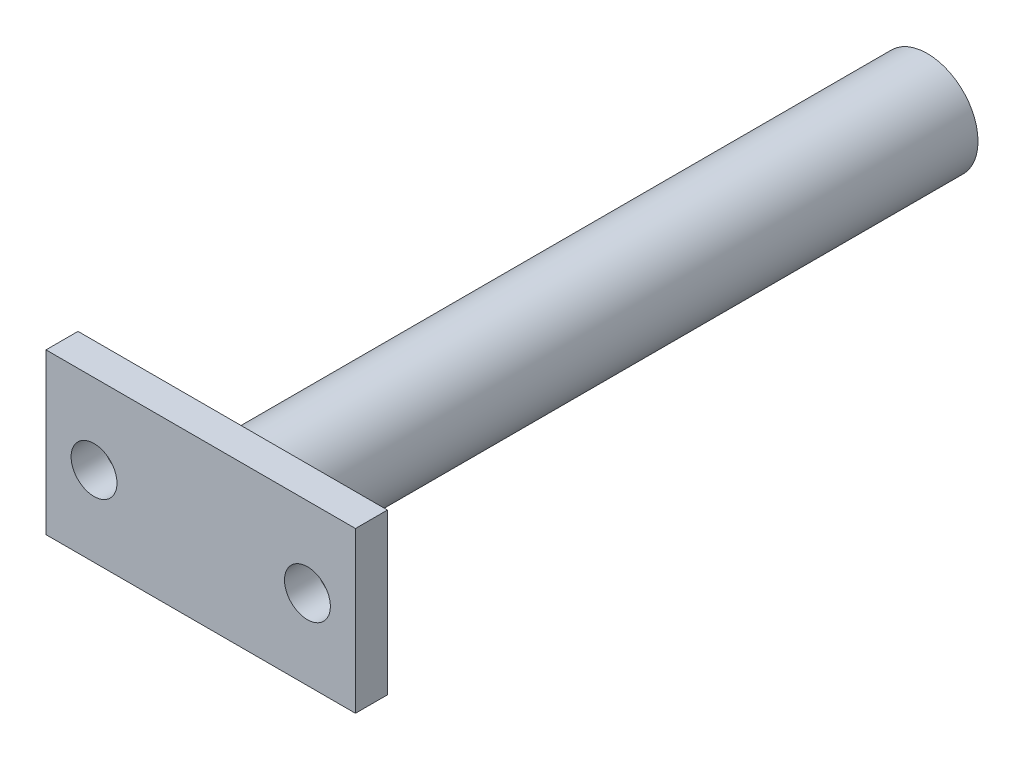
ISO-10303-21;
HEADER;
FILE_DESCRIPTION(('STEP AP214'),'2;1');
FILE_NAME('part.step','',(''),(''),'','','');
FILE_SCHEMA(('AUTOMOTIVE_DESIGN { 1 0 10303 214 1 1 1 1 }'));
ENDSEC;
DATA;
#1=APPLICATION_CONTEXT('core data for automotive mechanical design processes');
#2=APPLICATION_PROTOCOL_DEFINITION('international standard','automotive_design',2000,#1);
#3=PRODUCT_CONTEXT('',#1,'mechanical');
#4=PRODUCT('Part','Part','',(#3));
#5=PRODUCT_RELATED_PRODUCT_CATEGORY('part','',(#4));
#6=PRODUCT_DEFINITION_FORMATION('','',#4);
#7=PRODUCT_DEFINITION_CONTEXT('part definition',#1,'design');
#8=PRODUCT_DEFINITION('design','',#6,#7);
#9=PRODUCT_DEFINITION_SHAPE('','',#8);
#10=(LENGTH_UNIT() NAMED_UNIT(*) SI_UNIT(.MILLI.,.METRE.));
#11=(NAMED_UNIT(*) PLANE_ANGLE_UNIT() SI_UNIT($,.RADIAN.));
#12=(NAMED_UNIT(*) SI_UNIT($,.STERADIAN.) SOLID_ANGLE_UNIT());
#13=UNCERTAINTY_MEASURE_WITH_UNIT(LENGTH_MEASURE(1.E-05),#10,'distance_accuracy_value','');
#14=(GEOMETRIC_REPRESENTATION_CONTEXT(3) GLOBAL_UNCERTAINTY_ASSIGNED_CONTEXT((#13)) GLOBAL_UNIT_ASSIGNED_CONTEXT((#10,
#11,#12)) REPRESENTATION_CONTEXT('',''));
#15=CARTESIAN_POINT('',(0.,0.,0.));
#16=DIRECTION('',(0.,0.,1.));
#17=DIRECTION('',(1.,0.,0.));
#18=AXIS2_PLACEMENT_3D('',#15,#16,#17);
#19=CARTESIAN_POINT('',(-27.6328666396553,0.,3.));
#20=DIRECTION('',(-1.,0.,0.));
#21=DIRECTION('',(0.,0.,1.));
#22=AXIS2_PLACEMENT_3D('',#19,#20,#21);
#23=PLANE('',#22);
#24=DIRECTION('',(0.,1.,0.));
#25=VECTOR('',#24,1.);
#26=CARTESIAN_POINT('',(-27.6328666396553,0.,0.));
#27=LINE('',#26,#25);
#28=CARTESIAN_POINT('',(-27.6328666396553,0.593964388251606,0.));
#29=VERTEX_POINT('',#28);
#30=CARTESIAN_POINT('',(-27.6328666396553,15.5939643882516,0.));
#31=VERTEX_POINT('',#30);
#32=EDGE_CURVE('E105',#29,#31,#27,.T.);
#33=ORIENTED_EDGE('',*,*,#32,.F.);
#34=DIRECTION('',(0.,0.,-1.));
#35=VECTOR('',#34,1.);
#36=CARTESIAN_POINT('',(-27.6328666396553,0.593964388251606,3.));
#37=LINE('',#36,#35);
#38=CARTESIAN_POINT('',(-27.6328666396553,0.593964388251606,3.));
#39=VERTEX_POINT('',#38);
#40=EDGE_CURVE('E11',#39,#29,#37,.T.);
#41=ORIENTED_EDGE('',*,*,#40,.F.);
#42=DIRECTION('',(0.,1.,0.));
#43=VECTOR('',#42,1.);
#44=CARTESIAN_POINT('',(-27.6328666396553,0.,3.));
#45=LINE('',#44,#43);
#46=CARTESIAN_POINT('',(-27.6328666396553,15.5939643882516,3.));
#47=VERTEX_POINT('',#46);
#48=EDGE_CURVE('E89',#39,#47,#45,.T.);
#49=ORIENTED_EDGE('',*,*,#48,.T.);
#50=DIRECTION('',(0.,0.,-1.));
#51=VECTOR('',#50,1.);
#52=CARTESIAN_POINT('',(-27.6328666396553,15.5939643882516,3.));
#53=LINE('',#52,#51);
#54=EDGE_CURVE('E51',#47,#31,#53,.T.);
#55=ORIENTED_EDGE('',*,*,#54,.T.);
#56=EDGE_LOOP('',(#33,#41,#49,#55));
#57=FACE_BOUND('',#56,.T.);
#58=ADVANCED_FACE('F34',(#57),#23,.T.);
#59=CARTESIAN_POINT('',(0.,0.593964388251606,3.));
#60=DIRECTION('',(0.,1.,0.));
#61=DIRECTION('',(0.,0.,1.));
#62=AXIS2_PLACEMENT_3D('',#59,#60,#61);
#63=PLANE('',#62);
#64=DIRECTION('',(1.,0.,0.));
#65=VECTOR('',#64,1.);
#66=CARTESIAN_POINT('',(0.,0.593964388251606,0.));
#67=LINE('',#66,#65);
#68=CARTESIAN_POINT('',(1.3671333603447,0.593964388251606,0.));
#69=VERTEX_POINT('',#68);
#70=EDGE_CURVE('E94',#29,#69,#67,.T.);
#71=ORIENTED_EDGE('',*,*,#70,.T.);
#72=DIRECTION('',(0.,0.,-1.));
#73=VECTOR('',#72,1.);
#74=CARTESIAN_POINT('',(1.3671333603447,0.593964388251606,3.));
#75=LINE('',#74,#73);
#76=CARTESIAN_POINT('',(1.3671333603447,0.593964388251606,3.));
#77=VERTEX_POINT('',#76);
#78=EDGE_CURVE('E43',#77,#69,#75,.T.);
#79=ORIENTED_EDGE('',*,*,#78,.F.);
#80=DIRECTION('',(1.,0.,0.));
#81=VECTOR('',#80,1.);
#82=CARTESIAN_POINT('',(0.,0.593964388251606,3.));
#83=LINE('',#82,#81);
#84=EDGE_CURVE('E85',#39,#77,#83,.T.);
#85=ORIENTED_EDGE('',*,*,#84,.F.);
#86=ORIENTED_EDGE('',*,*,#40,.T.);
#87=EDGE_LOOP('',(#71,#79,#85,#86));
#88=FACE_BOUND('',#87,.T.);
#89=ADVANCED_FACE('F92',(#88),#63,.F.);
#90=CARTESIAN_POINT('',(1.3671333603447,0.,3.));
#91=DIRECTION('',(-1.,0.,0.));
#92=DIRECTION('',(0.,-1.,0.));
#93=AXIS2_PLACEMENT_3D('',#90,#91,#92);
#94=PLANE('',#93);
#95=DIRECTION('',(0.,1.,0.));
#96=VECTOR('',#95,1.);
#97=CARTESIAN_POINT('',(1.3671333603447,0.,0.));
#98=LINE('',#97,#96);
#99=CARTESIAN_POINT('',(1.3671333603447,15.5939643882516,0.));
#100=VERTEX_POINT('',#99);
#101=EDGE_CURVE('E102',#69,#100,#98,.T.);
#102=ORIENTED_EDGE('',*,*,#101,.T.);
#103=DIRECTION('',(0.,0.,-1.));
#104=VECTOR('',#103,1.);
#105=CARTESIAN_POINT('',(1.3671333603447,15.5939643882516,3.));
#106=LINE('',#105,#104);
#107=CARTESIAN_POINT('',(1.3671333603447,15.5939643882516,3.));
#108=VERTEX_POINT('',#107);
#109=EDGE_CURVE('E65',#108,#100,#106,.T.);
#110=ORIENTED_EDGE('',*,*,#109,.F.);
#111=DIRECTION('',(0.,1.,0.));
#112=VECTOR('',#111,1.);
#113=CARTESIAN_POINT('',(1.3671333603447,0.,3.));
#114=LINE('',#113,#112);
#115=EDGE_CURVE('E77',#77,#108,#114,.T.);
#116=ORIENTED_EDGE('',*,*,#115,.F.);
#117=ORIENTED_EDGE('',*,*,#78,.T.);
#118=EDGE_LOOP('',(#102,#110,#116,#117));
#119=FACE_BOUND('',#118,.T.);
#120=ADVANCED_FACE('F79',(#119),#94,.F.);
#121=CARTESIAN_POINT('',(-3.1328666396553,8.09396438825161,3.));
#122=DIRECTION('',(0.,0.,-1.));
#123=DIRECTION('',(-1.,0.,0.));
#124=AXIS2_PLACEMENT_3D('',#121,#122,#123);
#125=CYLINDRICAL_SURFACE('',#124,2.15);
#126=CARTESIAN_POINT('',(-3.1328666396553,8.09396438825161,3.));
#127=DIRECTION('',(0.,0.,1.));
#128=DIRECTION('',(1.,0.,0.));
#129=AXIS2_PLACEMENT_3D('',#126,#127,#128);
#130=CIRCLE('',#129,2.15);
#131=CARTESIAN_POINT('',(-0.982866639655303,8.09396438825161,3.));
#132=VERTEX_POINT('',#131);
#133=EDGE_CURVE('E116',#132,#132,#130,.T.);
#134=ORIENTED_EDGE('',*,*,#133,.T.);
#135=EDGE_LOOP('',(#134));
#136=FACE_BOUND('',#135,.T.);
#137=CARTESIAN_POINT('',(-3.1328666396553,8.09396438825161,0.));
#138=DIRECTION('',(0.,0.,1.));
#139=DIRECTION('',(1.,0.,0.));
#140=AXIS2_PLACEMENT_3D('',#137,#138,#139);
#141=CIRCLE('',#140,2.15);
#142=CARTESIAN_POINT('',(-0.982866639655303,8.09396438825161,0.));
#143=VERTEX_POINT('',#142);
#144=EDGE_CURVE('E107',#143,#143,#141,.T.);
#145=ORIENTED_EDGE('',*,*,#144,.F.);
#146=EDGE_LOOP('',(#145));
#147=FACE_BOUND('',#146,.T.);
#148=ADVANCED_FACE('F148',(#136,#147),#125,.F.);
#149=CARTESIAN_POINT('',(-23.1328666396553,8.09396438825161,3.));
#150=DIRECTION('',(0.,0.,-1.));
#151=DIRECTION('',(-1.,0.,0.));
#152=AXIS2_PLACEMENT_3D('',#149,#150,#151);
#153=CYLINDRICAL_SURFACE('',#152,2.15);
#154=CARTESIAN_POINT('',(-23.1328666396553,8.09396438825161,3.));
#155=DIRECTION('',(0.,0.,1.));
#156=DIRECTION('',(1.,0.,0.));
#157=AXIS2_PLACEMENT_3D('',#154,#155,#156);
#158=CIRCLE('',#157,2.15);
#159=CARTESIAN_POINT('',(-20.9828666396553,8.09396438825161,3.));
#160=VERTEX_POINT('',#159);
#161=EDGE_CURVE('E101',#160,#160,#158,.T.);
#162=ORIENTED_EDGE('',*,*,#161,.T.);
#163=EDGE_LOOP('',(#162));
#164=FACE_BOUND('',#163,.T.);
#165=CARTESIAN_POINT('',(-23.1328666396553,8.09396438825161,0.));
#166=DIRECTION('',(0.,0.,1.));
#167=DIRECTION('',(1.,0.,0.));
#168=AXIS2_PLACEMENT_3D('',#165,#166,#167);
#169=CIRCLE('',#168,2.15);
#170=CARTESIAN_POINT('',(-20.9828666396553,8.09396438825161,0.));
#171=VERTEX_POINT('',#170);
#172=EDGE_CURVE('E110',#171,#171,#169,.T.);
#173=ORIENTED_EDGE('',*,*,#172,.F.);
#174=EDGE_LOOP('',(#173));
#175=FACE_BOUND('',#174,.T.);
#176=ADVANCED_FACE('F36',(#164,#175),#153,.F.);
#177=CARTESIAN_POINT('',(0.,15.5939643882516,3.));
#178=DIRECTION('',(0.,1.,0.));
#179=DIRECTION('',(0.,0.,1.));
#180=AXIS2_PLACEMENT_3D('',#177,#178,#179);
#181=PLANE('',#180);
#182=DIRECTION('',(1.,0.,0.));
#183=VECTOR('',#182,1.);
#184=CARTESIAN_POINT('',(0.,15.5939643882516,0.));
#185=LINE('',#184,#183);
#186=EDGE_CURVE('E98',#31,#100,#185,.T.);
#187=ORIENTED_EDGE('',*,*,#186,.F.);
#188=ORIENTED_EDGE('',*,*,#54,.F.);
#189=DIRECTION('',(1.,0.,0.));
#190=VECTOR('',#189,1.);
#191=CARTESIAN_POINT('',(0.,15.5939643882516,3.));
#192=LINE('',#191,#190);
#193=EDGE_CURVE('E84',#47,#108,#192,.T.);
#194=ORIENTED_EDGE('',*,*,#193,.T.);
#195=ORIENTED_EDGE('',*,*,#109,.T.);
#196=EDGE_LOOP('',(#187,#188,#194,#195));
#197=FACE_BOUND('',#196,.T.);
#198=ADVANCED_FACE('F155',(#197),#181,.T.);
#199=CARTESIAN_POINT('',(0.,0.,3.));
#200=DIRECTION('',(0.,0.,1.));
#201=DIRECTION('',(1.,0.,0.));
#202=AXIS2_PLACEMENT_3D('',#199,#200,#201);
#203=PLANE('',#202);
#204=ORIENTED_EDGE('',*,*,#161,.F.);
#205=EDGE_LOOP('',(#204));
#206=FACE_BOUND('',#205,.T.);
#207=ORIENTED_EDGE('',*,*,#133,.F.);
#208=EDGE_LOOP('',(#207));
#209=FACE_BOUND('',#208,.T.);
#210=ORIENTED_EDGE('',*,*,#48,.F.);
#211=ORIENTED_EDGE('',*,*,#84,.T.);
#212=ORIENTED_EDGE('',*,*,#115,.T.);
#213=ORIENTED_EDGE('',*,*,#193,.F.);
#214=EDGE_LOOP('',(#210,#211,#212,#213));
#215=FACE_BOUND('',#214,.T.);
#216=ADVANCED_FACE('F88',(#206,#209,#215),#203,.T.);
#217=CARTESIAN_POINT('',(0.,0.,0.));
#218=DIRECTION('',(0.,0.,1.));
#219=DIRECTION('',(1.,0.,0.));
#220=AXIS2_PLACEMENT_3D('',#217,#218,#219);
#221=PLANE('',#220);
#222=ORIENTED_EDGE('',*,*,#172,.T.);
#223=EDGE_LOOP('',(#222));
#224=FACE_BOUND('',#223,.T.);
#225=ORIENTED_EDGE('',*,*,#144,.T.);
#226=EDGE_LOOP('',(#225));
#227=FACE_BOUND('',#226,.T.);
#228=CARTESIAN_POINT('',(-13.1403651716582,8.09396438825161,0.));
#229=DIRECTION('',(0.,0.,1.));
#230=DIRECTION('',(1.,0.,0.));
#231=AXIS2_PLACEMENT_3D('',#228,#229,#230);
#232=CIRCLE('',#231,4.75);
#233=CARTESIAN_POINT('',(-8.39036517165817,8.09396438825161,0.));
#234=VERTEX_POINT('',#233);
#235=EDGE_CURVE('E113',#234,#234,#232,.F.);
#236=ORIENTED_EDGE('',*,*,#235,.F.);
#237=EDGE_LOOP('',(#236));
#238=FACE_BOUND('',#237,.T.);
#239=ORIENTED_EDGE('',*,*,#32,.T.);
#240=ORIENTED_EDGE('',*,*,#186,.T.);
#241=ORIENTED_EDGE('',*,*,#101,.F.);
#242=ORIENTED_EDGE('',*,*,#70,.F.);
#243=EDGE_LOOP('',(#239,#240,#241,#242));
#244=FACE_BOUND('',#243,.T.);
#245=ADVANCED_FACE('F132',(#224,#227,#238,#244),#221,.F.);
#246=CARTESIAN_POINT('',(0.,0.,-65.1));
#247=DIRECTION('',(0.,0.,1.));
#248=DIRECTION('',(1.,0.,0.));
#249=AXIS2_PLACEMENT_3D('',#246,#247,#248);
#250=PLANE('',#249);
#251=CARTESIAN_POINT('',(-13.1403651716582,8.09396438825161,-65.1));
#252=DIRECTION('',(0.,0.,1.));
#253=DIRECTION('',(1.,0.,0.));
#254=AXIS2_PLACEMENT_3D('',#251,#252,#253);
#255=CIRCLE('',#254,4.75);
#256=CARTESIAN_POINT('',(-8.39036517165817,8.09396438825161,-65.1));
#257=VERTEX_POINT('',#256);
#258=EDGE_CURVE('E123',#257,#257,#255,.T.);
#259=ORIENTED_EDGE('',*,*,#258,.F.);
#260=EDGE_LOOP('',(#259));
#261=FACE_BOUND('',#260,.T.);
#262=ADVANCED_FACE('F130',(#261),#250,.F.);
#263=CARTESIAN_POINT('',(-13.1403651716582,8.09396438825161,16.4350288425444));
#264=DIRECTION('',(0.,0.,-1.));
#265=DIRECTION('',(-1.,0.,0.));
#266=AXIS2_PLACEMENT_3D('',#263,#264,#265);
#267=CYLINDRICAL_SURFACE('',#266,4.75);
#268=ORIENTED_EDGE('',*,*,#258,.T.);
#269=EDGE_LOOP('',(#268));
#270=FACE_BOUND('',#269,.T.);
#271=ORIENTED_EDGE('',*,*,#235,.T.);
#272=EDGE_LOOP('',(#271));
#273=FACE_BOUND('',#272,.T.);
#274=ADVANCED_FACE('F127',(#270,#273),#267,.T.);
#275=CLOSED_SHELL('',(#58,#89,#120,#148,#176,#198,#216,#245,#262,#274));
#276=MANIFOLD_SOLID_BREP('B2',#275);
#277=ADVANCED_BREP_SHAPE_REPRESENTATION('',(#18,#276),#14);
#278=SHAPE_DEFINITION_REPRESENTATION(#9,#277);
ENDSEC;
END-ISO-10303-21;
